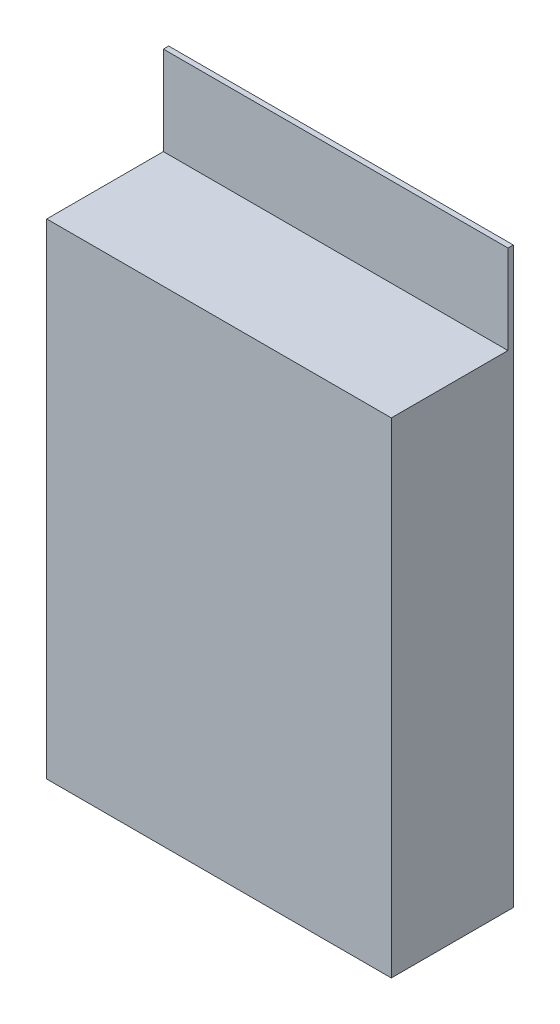
ISO-10303-21;
HEADER;
FILE_DESCRIPTION(('STEP AP214'),'2;1');
FILE_NAME('part.step','',(''),(''),'','','');
FILE_SCHEMA(('AUTOMOTIVE_DESIGN { 1 0 10303 214 1 1 1 1 }'));
ENDSEC;
DATA;
#1=APPLICATION_CONTEXT('core data for automotive mechanical design processes');
#2=APPLICATION_PROTOCOL_DEFINITION('international standard','automotive_design',2000,#1);
#3=PRODUCT_CONTEXT('',#1,'mechanical');
#4=PRODUCT('Part','Part','',(#3));
#5=PRODUCT_RELATED_PRODUCT_CATEGORY('part','',(#4));
#6=PRODUCT_DEFINITION_FORMATION('','',#4);
#7=PRODUCT_DEFINITION_CONTEXT('part definition',#1,'design');
#8=PRODUCT_DEFINITION('design','',#6,#7);
#9=PRODUCT_DEFINITION_SHAPE('','',#8);
#10=(LENGTH_UNIT() NAMED_UNIT(*) SI_UNIT(.MILLI.,.METRE.));
#11=(NAMED_UNIT(*) PLANE_ANGLE_UNIT() SI_UNIT($,.RADIAN.));
#12=(NAMED_UNIT(*) SI_UNIT($,.STERADIAN.) SOLID_ANGLE_UNIT());
#13=UNCERTAINTY_MEASURE_WITH_UNIT(LENGTH_MEASURE(1.E-05),#10,'distance_accuracy_value','');
#14=(GEOMETRIC_REPRESENTATION_CONTEXT(3) GLOBAL_UNCERTAINTY_ASSIGNED_CONTEXT((#13)) GLOBAL_UNIT_ASSIGNED_CONTEXT((#10,
#11,#12)) REPRESENTATION_CONTEXT('',''));
#15=CARTESIAN_POINT('',(0.,0.,0.));
#16=DIRECTION('',(0.,0.,1.));
#17=DIRECTION('',(1.,0.,0.));
#18=AXIS2_PLACEMENT_3D('',#15,#16,#17);
#19=CARTESIAN_POINT('',(-33.02,46.482,23.368));
#20=DIRECTION('',(0.,-1.,0.));
#21=DIRECTION('',(0.,0.,-1.));
#22=AXIS2_PLACEMENT_3D('',#19,#20,#21);
#23=PLANE('',#22);
#24=DIRECTION('',(1.,0.,0.));
#25=VECTOR('',#24,1.);
#26=CARTESIAN_POINT('',(-33.02,46.482,1.016));
#27=LINE('',#26,#25);
#28=CARTESIAN_POINT('',(-33.02,46.482,1.016));
#29=VERTEX_POINT('',#28);
#30=CARTESIAN_POINT('',(33.02,46.482,1.016));
#31=VERTEX_POINT('',#30);
#32=EDGE_CURVE('E51',#29,#31,#27,.T.);
#33=ORIENTED_EDGE('',*,*,#32,.F.);
#34=DIRECTION('',(0.,0.,-1.));
#35=VECTOR('',#34,1.);
#36=CARTESIAN_POINT('',(-33.02,46.482,23.368));
#37=LINE('',#36,#35);
#38=CARTESIAN_POINT('',(-33.02,46.482,23.368));
#39=VERTEX_POINT('',#38);
#40=EDGE_CURVE('E45',#39,#29,#37,.T.);
#41=ORIENTED_EDGE('',*,*,#40,.F.);
#42=DIRECTION('',(-1.,0.,0.));
#43=VECTOR('',#42,1.);
#44=CARTESIAN_POINT('',(-33.02,46.482,23.368));
#45=LINE('',#44,#43);
#46=CARTESIAN_POINT('',(33.02,46.482,23.368));
#47=VERTEX_POINT('',#46);
#48=EDGE_CURVE('E80',#47,#39,#45,.T.);
#49=ORIENTED_EDGE('',*,*,#48,.F.);
#50=DIRECTION('',(0.,0.,-1.));
#51=VECTOR('',#50,1.);
#52=CARTESIAN_POINT('',(33.02,46.482,23.368));
#53=LINE('',#52,#51);
#54=EDGE_CURVE('E11',#47,#31,#53,.T.);
#55=ORIENTED_EDGE('',*,*,#54,.T.);
#56=EDGE_LOOP('',(#33,#41,#49,#55));
#57=FACE_BOUND('',#56,.T.);
#58=ADVANCED_FACE('F37',(#57),#23,.F.);
#59=CARTESIAN_POINT('',(33.02,46.482,23.368));
#60=DIRECTION('',(-1.,0.,0.));
#61=DIRECTION('',(0.,-1.,0.));
#62=AXIS2_PLACEMENT_3D('',#59,#60,#61);
#63=PLANE('',#62);
#64=DIRECTION('',(0.,1.,0.));
#65=VECTOR('',#64,1.);
#66=CARTESIAN_POINT('',(33.02,46.482,0.));
#67=LINE('',#66,#65);
#68=CARTESIAN_POINT('',(33.02,-46.482,0.));
#69=VERTEX_POINT('',#68);
#70=CARTESIAN_POINT('',(33.02,63.5,0.));
#71=VERTEX_POINT('',#70);
#72=EDGE_CURVE('E119',#69,#71,#67,.T.);
#73=ORIENTED_EDGE('',*,*,#72,.T.);
#74=DIRECTION('',(0.,0.,-1.));
#75=VECTOR('',#74,1.);
#76=CARTESIAN_POINT('',(33.02,63.5,0.));
#77=LINE('',#76,#75);
#78=CARTESIAN_POINT('',(33.02,63.5,1.016));
#79=VERTEX_POINT('',#78);
#80=EDGE_CURVE('E107',#79,#71,#77,.T.);
#81=ORIENTED_EDGE('',*,*,#80,.F.);
#82=DIRECTION('',(0.,-1.,0.));
#83=VECTOR('',#82,1.);
#84=CARTESIAN_POINT('',(33.02,63.5,1.016));
#85=LINE('',#84,#83);
#86=EDGE_CURVE('E103',#79,#31,#85,.T.);
#87=ORIENTED_EDGE('',*,*,#86,.T.);
#88=ORIENTED_EDGE('',*,*,#54,.F.);
#89=DIRECTION('',(0.,1.,0.));
#90=VECTOR('',#89,1.);
#91=CARTESIAN_POINT('',(33.02,46.482,23.368));
#92=LINE('',#91,#90);
#93=CARTESIAN_POINT('',(33.02,-46.482,23.368));
#94=VERTEX_POINT('',#93);
#95=EDGE_CURVE('E126',#94,#47,#92,.T.);
#96=ORIENTED_EDGE('',*,*,#95,.F.);
#97=DIRECTION('',(0.,0.,-1.));
#98=VECTOR('',#97,1.);
#99=CARTESIAN_POINT('',(33.02,-46.482,23.368));
#100=LINE('',#99,#98);
#101=EDGE_CURVE('E131',#94,#69,#100,.T.);
#102=ORIENTED_EDGE('',*,*,#101,.T.);
#103=EDGE_LOOP('',(#73,#81,#87,#88,#96,#102));
#104=FACE_BOUND('',#103,.T.);
#105=ADVANCED_FACE('F39',(#104),#63,.F.);
#106=CARTESIAN_POINT('',(-33.02,46.482,23.368));
#107=DIRECTION('',(1.,0.,0.));
#108=DIRECTION('',(0.,1.,0.));
#109=AXIS2_PLACEMENT_3D('',#106,#107,#108);
#110=PLANE('',#109);
#111=DIRECTION('',(0.,-1.,0.));
#112=VECTOR('',#111,1.);
#113=CARTESIAN_POINT('',(-33.02,46.482,0.));
#114=LINE('',#113,#112);
#115=CARTESIAN_POINT('',(-33.02,63.5,0.));
#116=VERTEX_POINT('',#115);
#117=CARTESIAN_POINT('',(-33.02,-46.482,0.));
#118=VERTEX_POINT('',#117);
#119=EDGE_CURVE('E121',#116,#118,#114,.T.);
#120=ORIENTED_EDGE('',*,*,#119,.T.);
#121=DIRECTION('',(0.,0.,-1.));
#122=VECTOR('',#121,1.);
#123=CARTESIAN_POINT('',(-33.02,-46.482,23.368));
#124=LINE('',#123,#122);
#125=CARTESIAN_POINT('',(-33.02,-46.482,23.368));
#126=VERTEX_POINT('',#125);
#127=EDGE_CURVE('E136',#126,#118,#124,.T.);
#128=ORIENTED_EDGE('',*,*,#127,.F.);
#129=DIRECTION('',(0.,-1.,0.));
#130=VECTOR('',#129,1.);
#131=CARTESIAN_POINT('',(-33.02,46.482,23.368));
#132=LINE('',#131,#130);
#133=EDGE_CURVE('E129',#39,#126,#132,.T.);
#134=ORIENTED_EDGE('',*,*,#133,.F.);
#135=ORIENTED_EDGE('',*,*,#40,.T.);
#136=DIRECTION('',(0.,-1.,0.));
#137=VECTOR('',#136,1.);
#138=CARTESIAN_POINT('',(-33.02,63.5,1.016));
#139=LINE('',#138,#137);
#140=CARTESIAN_POINT('',(-33.02,63.5,1.016));
#141=VERTEX_POINT('',#140);
#142=EDGE_CURVE('E101',#141,#29,#139,.T.);
#143=ORIENTED_EDGE('',*,*,#142,.F.);
#144=DIRECTION('',(0.,0.,1.));
#145=VECTOR('',#144,1.);
#146=CARTESIAN_POINT('',(-33.02,63.5,0.));
#147=LINE('',#146,#145);
#148=EDGE_CURVE('E108',#116,#141,#147,.T.);
#149=ORIENTED_EDGE('',*,*,#148,.F.);
#150=EDGE_LOOP('',(#120,#128,#134,#135,#143,#149));
#151=FACE_BOUND('',#150,.T.);
#152=ADVANCED_FACE('F117',(#151),#110,.F.);
#153=CARTESIAN_POINT('',(-33.02,-46.482,23.368));
#154=DIRECTION('',(0.,1.,0.));
#155=DIRECTION('',(0.,0.,1.));
#156=AXIS2_PLACEMENT_3D('',#153,#154,#155);
#157=PLANE('',#156);
#158=DIRECTION('',(1.,0.,0.));
#159=VECTOR('',#158,1.);
#160=CARTESIAN_POINT('',(-33.02,-46.482,0.));
#161=LINE('',#160,#159);
#162=EDGE_CURVE('E75',#118,#69,#161,.T.);
#163=ORIENTED_EDGE('',*,*,#162,.T.);
#164=ORIENTED_EDGE('',*,*,#101,.F.);
#165=DIRECTION('',(1.,0.,0.));
#166=VECTOR('',#165,1.);
#167=CARTESIAN_POINT('',(-33.02,-46.482,23.368));
#168=LINE('',#167,#166);
#169=EDGE_CURVE('E60',#126,#94,#168,.T.);
#170=ORIENTED_EDGE('',*,*,#169,.F.);
#171=ORIENTED_EDGE('',*,*,#127,.T.);
#172=EDGE_LOOP('',(#163,#164,#170,#171));
#173=FACE_BOUND('',#172,.T.);
#174=ADVANCED_FACE('F138',(#173),#157,.F.);
#175=CARTESIAN_POINT('',(0.,0.,23.368));
#176=DIRECTION('',(0.,0.,1.));
#177=DIRECTION('',(1.,0.,0.));
#178=AXIS2_PLACEMENT_3D('',#175,#176,#177);
#179=PLANE('',#178);
#180=ORIENTED_EDGE('',*,*,#95,.T.);
#181=ORIENTED_EDGE('',*,*,#48,.T.);
#182=ORIENTED_EDGE('',*,*,#133,.T.);
#183=ORIENTED_EDGE('',*,*,#169,.T.);
#184=EDGE_LOOP('',(#180,#181,#182,#183));
#185=FACE_BOUND('',#184,.T.);
#186=ADVANCED_FACE('F156',(#185),#179,.T.);
#187=CARTESIAN_POINT('',(0.,0.,0.));
#188=DIRECTION('',(0.,0.,1.));
#189=DIRECTION('',(1.,0.,0.));
#190=AXIS2_PLACEMENT_3D('',#187,#188,#189);
#191=PLANE('',#190);
#192=ORIENTED_EDGE('',*,*,#72,.F.);
#193=ORIENTED_EDGE('',*,*,#162,.F.);
#194=ORIENTED_EDGE('',*,*,#119,.F.);
#195=DIRECTION('',(-1.,0.,0.));
#196=VECTOR('',#195,1.);
#197=CARTESIAN_POINT('',(-33.02,63.5,0.));
#198=LINE('',#197,#196);
#199=EDGE_CURVE('E114',#71,#116,#198,.T.);
#200=ORIENTED_EDGE('',*,*,#199,.F.);
#201=EDGE_LOOP('',(#192,#193,#194,#200));
#202=FACE_BOUND('',#201,.T.);
#203=ADVANCED_FACE('F141',(#202),#191,.F.);
#204=CARTESIAN_POINT('',(-33.02,63.5,1.016));
#205=DIRECTION('',(0.,0.,-1.));
#206=DIRECTION('',(-1.,0.,0.));
#207=AXIS2_PLACEMENT_3D('',#204,#205,#206);
#208=PLANE('',#207);
#209=ORIENTED_EDGE('',*,*,#32,.T.);
#210=ORIENTED_EDGE('',*,*,#86,.F.);
#211=DIRECTION('',(1.,0.,0.));
#212=VECTOR('',#211,1.);
#213=CARTESIAN_POINT('',(-33.02,63.5,1.016));
#214=LINE('',#213,#212);
#215=EDGE_CURVE('E97',#141,#79,#214,.T.);
#216=ORIENTED_EDGE('',*,*,#215,.F.);
#217=ORIENTED_EDGE('',*,*,#142,.T.);
#218=EDGE_LOOP('',(#209,#210,#216,#217));
#219=FACE_BOUND('',#218,.T.);
#220=ADVANCED_FACE('F99',(#219),#208,.F.);
#221=CARTESIAN_POINT('',(0.,63.5,0.));
#222=DIRECTION('',(0.,1.,0.));
#223=DIRECTION('',(0.,0.,1.));
#224=AXIS2_PLACEMENT_3D('',#221,#222,#223);
#225=PLANE('',#224);
#226=ORIENTED_EDGE('',*,*,#148,.T.);
#227=ORIENTED_EDGE('',*,*,#215,.T.);
#228=ORIENTED_EDGE('',*,*,#80,.T.);
#229=ORIENTED_EDGE('',*,*,#199,.T.);
#230=EDGE_LOOP('',(#226,#227,#228,#229));
#231=FACE_BOUND('',#230,.T.);
#232=ADVANCED_FACE('F112',(#231),#225,.T.);
#233=CLOSED_SHELL('',(#58,#105,#152,#174,#186,#203,#220,#232));
#234=MANIFOLD_SOLID_BREP('B2',#233);
#235=ADVANCED_BREP_SHAPE_REPRESENTATION('',(#18,#234),#14);
#236=SHAPE_DEFINITION_REPRESENTATION(#9,#235);
ENDSEC;
END-ISO-10303-21;
